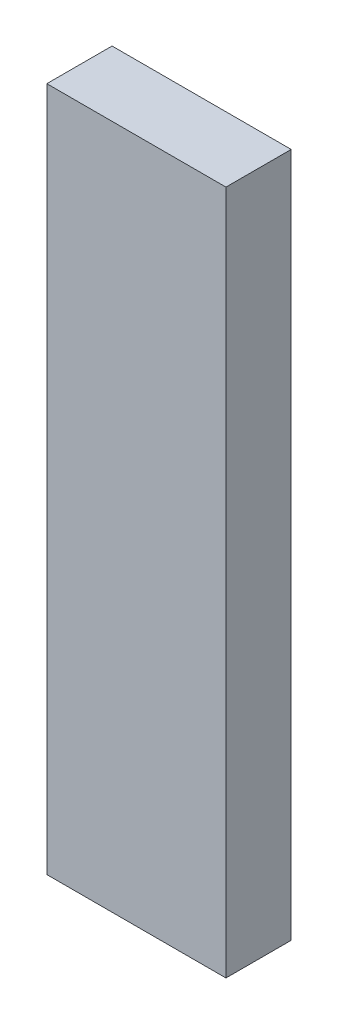
ISO-10303-21;
HEADER;
FILE_DESCRIPTION(('STEP AP214'),'2;1');
FILE_NAME('part.step','',(''),(''),'','','');
FILE_SCHEMA(('AUTOMOTIVE_DESIGN { 1 0 10303 214 1 1 1 1 }'));
ENDSEC;
DATA;
#1=APPLICATION_CONTEXT('core data for automotive mechanical design processes');
#2=APPLICATION_PROTOCOL_DEFINITION('international standard','automotive_design',2000,#1);
#3=PRODUCT_CONTEXT('',#1,'mechanical');
#4=PRODUCT('Part','Part','',(#3));
#5=PRODUCT_RELATED_PRODUCT_CATEGORY('part','',(#4));
#6=PRODUCT_DEFINITION_FORMATION('','',#4);
#7=PRODUCT_DEFINITION_CONTEXT('part definition',#1,'design');
#8=PRODUCT_DEFINITION('design','',#6,#7);
#9=PRODUCT_DEFINITION_SHAPE('','',#8);
#10=(LENGTH_UNIT() NAMED_UNIT(*) SI_UNIT(.MILLI.,.METRE.));
#11=(NAMED_UNIT(*) PLANE_ANGLE_UNIT() SI_UNIT($,.RADIAN.));
#12=(NAMED_UNIT(*) SI_UNIT($,.STERADIAN.) SOLID_ANGLE_UNIT());
#13=UNCERTAINTY_MEASURE_WITH_UNIT(LENGTH_MEASURE(1.E-05),#10,'distance_accuracy_value','');
#14=(GEOMETRIC_REPRESENTATION_CONTEXT(3) GLOBAL_UNCERTAINTY_ASSIGNED_CONTEXT((#13)) GLOBAL_UNIT_ASSIGNED_CONTEXT((#10,
#11,#12)) REPRESENTATION_CONTEXT('',''));
#15=CARTESIAN_POINT('',(0.,0.,0.));
#16=DIRECTION('',(0.,0.,1.));
#17=DIRECTION('',(1.,0.,0.));
#18=AXIS2_PLACEMENT_3D('',#15,#16,#17);
#19=CARTESIAN_POINT('',(8.6487,66.1416,3.1496));
#20=DIRECTION('',(-1.,0.,0.));
#21=DIRECTION('',(0.,0.,1.));
#22=AXIS2_PLACEMENT_3D('',#19,#20,#21);
#23=PLANE('',#22);
#24=DIRECTION('',(0.,0.,-1.));
#25=VECTOR('',#24,1.);
#26=CARTESIAN_POINT('',(8.6487,0.,3.1496));
#27=LINE('',#26,#25);
#28=CARTESIAN_POINT('',(8.6487,0.,3.1496));
#29=VERTEX_POINT('',#28);
#30=CARTESIAN_POINT('',(8.6487,0.,-3.1496));
#31=VERTEX_POINT('',#30);
#32=EDGE_CURVE('E113',#29,#31,#27,.T.);
#33=ORIENTED_EDGE('',*,*,#32,.T.);
#34=DIRECTION('',(0.,-1.,0.));
#35=VECTOR('',#34,1.);
#36=CARTESIAN_POINT('',(8.6487,66.1416,-3.1496));
#37=LINE('',#36,#35);
#38=CARTESIAN_POINT('',(8.6487,66.1416,-3.1496));
#39=VERTEX_POINT('',#38);
#40=EDGE_CURVE('E11',#39,#31,#37,.T.);
#41=ORIENTED_EDGE('',*,*,#40,.F.);
#42=DIRECTION('',(0.,0.,-1.));
#43=VECTOR('',#42,1.);
#44=CARTESIAN_POINT('',(8.6487,66.1416,3.1496));
#45=LINE('',#44,#43);
#46=CARTESIAN_POINT('',(8.6487,66.1416,3.1496));
#47=VERTEX_POINT('',#46);
#48=EDGE_CURVE('E97',#47,#39,#45,.T.);
#49=ORIENTED_EDGE('',*,*,#48,.F.);
#50=DIRECTION('',(0.,-1.,0.));
#51=VECTOR('',#50,1.);
#52=CARTESIAN_POINT('',(8.6487,66.1416,3.1496));
#53=LINE('',#52,#51);
#54=EDGE_CURVE('E109',#47,#29,#53,.T.);
#55=ORIENTED_EDGE('',*,*,#54,.T.);
#56=EDGE_LOOP('',(#33,#41,#49,#55));
#57=FACE_BOUND('',#56,.T.);
#58=ADVANCED_FACE('F45',(#57),#23,.F.);
#59=CARTESIAN_POINT('',(-8.6487,66.1416,-3.1496));
#60=DIRECTION('',(0.,0.,1.));
#61=DIRECTION('',(1.,0.,0.));
#62=AXIS2_PLACEMENT_3D('',#59,#60,#61);
#63=PLANE('',#62);
#64=DIRECTION('',(-1.,0.,0.));
#65=VECTOR('',#64,1.);
#66=CARTESIAN_POINT('',(-8.6487,0.,-3.1496));
#67=LINE('',#66,#65);
#68=CARTESIAN_POINT('',(-8.6487,0.,-3.1496));
#69=VERTEX_POINT('',#68);
#70=EDGE_CURVE('E102',#31,#69,#67,.T.);
#71=ORIENTED_EDGE('',*,*,#70,.T.);
#72=DIRECTION('',(0.,-1.,0.));
#73=VECTOR('',#72,1.);
#74=CARTESIAN_POINT('',(-8.6487,66.1416,-3.1496));
#75=LINE('',#74,#73);
#76=CARTESIAN_POINT('',(-8.6487,66.1416,-3.1496));
#77=VERTEX_POINT('',#76);
#78=EDGE_CURVE('E54',#77,#69,#75,.T.);
#79=ORIENTED_EDGE('',*,*,#78,.F.);
#80=DIRECTION('',(-1.,0.,0.));
#81=VECTOR('',#80,1.);
#82=CARTESIAN_POINT('',(-8.6487,66.1416,-3.1496));
#83=LINE('',#82,#81);
#84=EDGE_CURVE('E92',#39,#77,#83,.T.);
#85=ORIENTED_EDGE('',*,*,#84,.F.);
#86=ORIENTED_EDGE('',*,*,#40,.T.);
#87=EDGE_LOOP('',(#71,#79,#85,#86));
#88=FACE_BOUND('',#87,.T.);
#89=ADVANCED_FACE('F101',(#88),#63,.F.);
#90=CARTESIAN_POINT('',(-8.6487,66.1416,3.1496));
#91=DIRECTION('',(1.,0.,0.));
#92=DIRECTION('',(0.,0.,-1.));
#93=AXIS2_PLACEMENT_3D('',#90,#91,#92);
#94=PLANE('',#93);
#95=DIRECTION('',(0.,0.,1.));
#96=VECTOR('',#95,1.);
#97=CARTESIAN_POINT('',(-8.6487,0.,3.1496));
#98=LINE('',#97,#96);
#99=CARTESIAN_POINT('',(-8.6487,0.,3.1496));
#100=VERTEX_POINT('',#99);
#101=EDGE_CURVE('E79',#69,#100,#98,.T.);
#102=ORIENTED_EDGE('',*,*,#101,.T.);
#103=DIRECTION('',(0.,-1.,0.));
#104=VECTOR('',#103,1.);
#105=CARTESIAN_POINT('',(-8.6487,66.1416,3.1496));
#106=LINE('',#105,#104);
#107=CARTESIAN_POINT('',(-8.6487,66.1416,3.1496));
#108=VERTEX_POINT('',#107);
#109=EDGE_CURVE('E104',#108,#100,#106,.T.);
#110=ORIENTED_EDGE('',*,*,#109,.F.);
#111=DIRECTION('',(0.,0.,1.));
#112=VECTOR('',#111,1.);
#113=CARTESIAN_POINT('',(-8.6487,66.1416,3.1496));
#114=LINE('',#113,#112);
#115=EDGE_CURVE('E95',#77,#108,#114,.T.);
#116=ORIENTED_EDGE('',*,*,#115,.F.);
#117=ORIENTED_EDGE('',*,*,#78,.T.);
#118=EDGE_LOOP('',(#102,#110,#116,#117));
#119=FACE_BOUND('',#118,.T.);
#120=ADVANCED_FACE('F105',(#119),#94,.F.);
#121=CARTESIAN_POINT('',(-8.6487,66.1416,3.1496));
#122=DIRECTION('',(0.,0.,-1.));
#123=DIRECTION('',(-1.,0.,0.));
#124=AXIS2_PLACEMENT_3D('',#121,#122,#123);
#125=PLANE('',#124);
#126=DIRECTION('',(1.,0.,0.));
#127=VECTOR('',#126,1.);
#128=CARTESIAN_POINT('',(-8.6487,0.,3.1496));
#129=LINE('',#128,#127);
#130=EDGE_CURVE('E85',#100,#29,#129,.T.);
#131=ORIENTED_EDGE('',*,*,#130,.T.);
#132=ORIENTED_EDGE('',*,*,#54,.F.);
#133=DIRECTION('',(1.,0.,0.));
#134=VECTOR('',#133,1.);
#135=CARTESIAN_POINT('',(-8.6487,66.1416,3.1496));
#136=LINE('',#135,#134);
#137=EDGE_CURVE('E62',#108,#47,#136,.T.);
#138=ORIENTED_EDGE('',*,*,#137,.F.);
#139=ORIENTED_EDGE('',*,*,#109,.T.);
#140=EDGE_LOOP('',(#131,#132,#138,#139));
#141=FACE_BOUND('',#140,.T.);
#142=ADVANCED_FACE('F126',(#141),#125,.F.);
#143=CARTESIAN_POINT('',(0.,66.1416,0.));
#144=DIRECTION('',(0.,-1.,0.));
#145=DIRECTION('',(0.,0.,-1.));
#146=AXIS2_PLACEMENT_3D('',#143,#144,#145);
#147=PLANE('',#146);
#148=ORIENTED_EDGE('',*,*,#48,.T.);
#149=ORIENTED_EDGE('',*,*,#84,.T.);
#150=ORIENTED_EDGE('',*,*,#115,.T.);
#151=ORIENTED_EDGE('',*,*,#137,.T.);
#152=EDGE_LOOP('',(#148,#149,#150,#151));
#153=FACE_BOUND('',#152,.T.);
#154=ADVANCED_FACE('F93',(#153),#147,.F.);
#155=CARTESIAN_POINT('',(0.,0.,0.));
#156=DIRECTION('',(0.,-1.,0.));
#157=DIRECTION('',(0.,0.,-1.));
#158=AXIS2_PLACEMENT_3D('',#155,#156,#157);
#159=PLANE('',#158);
#160=ORIENTED_EDGE('',*,*,#32,.F.);
#161=ORIENTED_EDGE('',*,*,#130,.F.);
#162=ORIENTED_EDGE('',*,*,#101,.F.);
#163=ORIENTED_EDGE('',*,*,#70,.F.);
#164=EDGE_LOOP('',(#160,#161,#162,#163));
#165=FACE_BOUND('',#164,.T.);
#166=ADVANCED_FACE('F129',(#165),#159,.T.);
#167=CLOSED_SHELL('',(#58,#89,#120,#142,#154,#166));
#168=MANIFOLD_SOLID_BREP('B2',#167);
#169=ADVANCED_BREP_SHAPE_REPRESENTATION('',(#18,#168),#14);
#170=SHAPE_DEFINITION_REPRESENTATION(#9,#169);
ENDSEC;
END-ISO-10303-21;
